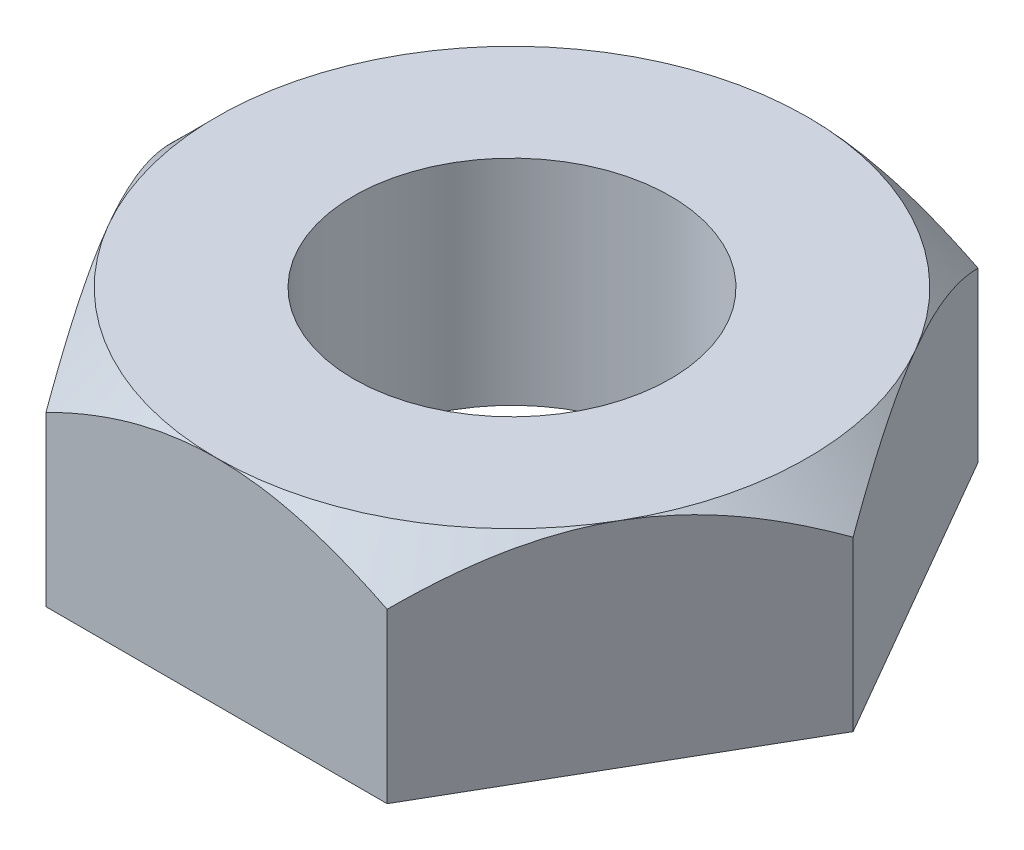
ISO-10303-21;
HEADER;
FILE_DESCRIPTION(('STEP AP214'),'2;1');
FILE_NAME('part.step','',(''),(''),'','','');
FILE_SCHEMA(('AUTOMOTIVE_DESIGN { 1 0 10303 214 1 1 1 1 }'));
ENDSEC;
DATA;
#1=APPLICATION_CONTEXT('core data for automotive mechanical design processes');
#2=APPLICATION_PROTOCOL_DEFINITION('international standard','automotive_design',2000,#1);
#3=PRODUCT_CONTEXT('',#1,'mechanical');
#4=PRODUCT('Part','Part','',(#3));
#5=PRODUCT_RELATED_PRODUCT_CATEGORY('part','',(#4));
#6=PRODUCT_DEFINITION_FORMATION('','',#4);
#7=PRODUCT_DEFINITION_CONTEXT('part definition',#1,'design');
#8=PRODUCT_DEFINITION('design','',#6,#7);
#9=PRODUCT_DEFINITION_SHAPE('','',#8);
#10=(LENGTH_UNIT() NAMED_UNIT(*) SI_UNIT(.MILLI.,.METRE.));
#11=(NAMED_UNIT(*) PLANE_ANGLE_UNIT() SI_UNIT($,.RADIAN.));
#12=(NAMED_UNIT(*) SI_UNIT($,.STERADIAN.) SOLID_ANGLE_UNIT());
#13=UNCERTAINTY_MEASURE_WITH_UNIT(LENGTH_MEASURE(1.E-05),#10,'distance_accuracy_value','');
#14=(GEOMETRIC_REPRESENTATION_CONTEXT(3) GLOBAL_UNCERTAINTY_ASSIGNED_CONTEXT((#13)) GLOBAL_UNIT_ASSIGNED_CONTEXT((#10,
#11,#12)) REPRESENTATION_CONTEXT('',''));
#15=CARTESIAN_POINT('',(0.,0.,0.));
#16=DIRECTION('',(0.,0.,1.));
#17=DIRECTION('',(1.,0.,0.));
#18=AXIS2_PLACEMENT_3D('',#15,#16,#17);
#19=CARTESIAN_POINT('',(0.,25.,0.));
#20=DIRECTION('',(0.,1.,0.));
#21=DIRECTION('',(0.,0.,1.));
#22=AXIS2_PLACEMENT_3D('',#19,#20,#21);
#23=PLANE('',#22);
#24=CARTESIAN_POINT('',(0.,25.,0.));
#25=DIRECTION('',(0.,1.,0.));
#26=DIRECTION('',(0.,0.,1.));
#27=AXIS2_PLACEMENT_3D('',#24,#25,#26);
#28=CIRCLE('',#27,18.5);
#29=CARTESIAN_POINT('',(0.,25.,18.5));
#30=VERTEX_POINT('',#29);
#31=EDGE_CURVE('E268',#30,#30,#28,.T.);
#32=ORIENTED_EDGE('',*,*,#31,.F.);
#33=EDGE_LOOP('',(#32));
#34=FACE_BOUND('',#33,.T.);
#35=CARTESIAN_POINT('',(0.,25.,0.));
#36=DIRECTION('',(0.,1.,0.));
#37=DIRECTION('',(0.,0.,1.));
#38=AXIS2_PLACEMENT_3D('',#35,#36,#37);
#39=CIRCLE('',#38,34.5);
#40=CARTESIAN_POINT('',(-29.877876430563,25.,17.2500000000002));
#41=VERTEX_POINT('',#40);
#42=CARTESIAN_POINT('',(3.60822483003176E-13,25.,34.5));
#43=VERTEX_POINT('',#42);
#44=EDGE_CURVE('E142',#41,#43,#39,.T.);
#45=ORIENTED_EDGE('',*,*,#44,.T.);
#46=CARTESIAN_POINT('',(29.8778764305634,25.,17.2499999999999));
#47=VERTEX_POINT('',#46);
#48=EDGE_CURVE('E126',#43,#47,#39,.T.);
#49=ORIENTED_EDGE('',*,*,#48,.T.);
#50=CARTESIAN_POINT('',(29.8778764305631,25.,-17.25));
#51=VERTEX_POINT('',#50);
#52=EDGE_CURVE('E116',#47,#51,#39,.T.);
#53=ORIENTED_EDGE('',*,*,#52,.T.);
#54=CARTESIAN_POINT('',(-1.20185167898972E-13,25.,-34.5));
#55=VERTEX_POINT('',#54);
#56=EDGE_CURVE('E60',#51,#55,#39,.T.);
#57=ORIENTED_EDGE('',*,*,#56,.T.);
#58=CARTESIAN_POINT('',(-29.8778764305632,25.,-17.2499999999998));
#59=VERTEX_POINT('',#58);
#60=EDGE_CURVE('E68',#55,#59,#39,.T.);
#61=ORIENTED_EDGE('',*,*,#60,.T.);
#62=EDGE_CURVE('E146',#59,#41,#39,.T.);
#63=ORIENTED_EDGE('',*,*,#62,.T.);
#64=EDGE_LOOP('',(#45,#49,#53,#57,#61,#63));
#65=FACE_BOUND('',#64,.T.);
#66=ADVANCED_FACE('F38',(#34,#65),#23,.T.);
#67=CARTESIAN_POINT('',(19.9185842870425,25.,34.4999999999998));
#68=DIRECTION('',(-0.866025403784441,0.,-0.499999999999995));
#69=DIRECTION('',(-0.499999999999995,0.,0.866025403784441));
#70=AXIS2_PLACEMENT_3D('',#67,#68,#69);
#71=PLANE('',#70);
#72=CARTESIAN_POINT('',(19.9184688169887,19.6627159553599,34.5001999999998));
#73=CARTESIAN_POINT('',(20.2609064330095,20.0050974602634,33.9070806506289));
#74=CARTESIAN_POINT('',(20.6060258774002,20.3370310575914,33.3093162382643));
#75=CARTESIAN_POINT('',(21.3020457610891,20.9766838039428,32.1037744366369));
#76=CARTESIAN_POINT('',(21.6529492327176,21.2843897293406,31.4959917952241));
#77=CARTESIAN_POINT('',(22.3626094509886,21.8735715205033,30.2668242410682));
#78=CARTESIAN_POINT('',(22.7213996575819,22.1548871259177,29.6453813739904));
#79=CARTESIAN_POINT('',(23.4448731210173,22.6851784375072,28.3922885773926));
#80=CARTESIAN_POINT('',(23.8095554673209,22.9341590878028,27.7606402249713));
#81=CARTESIAN_POINT('',(24.5389204879796,23.3918858727038,26.4973429519269));
#82=CARTESIAN_POINT('',(24.9035131138699,23.6012027501782,25.8658499998199));
#83=CARTESIAN_POINT('',(25.6378697047822,23.9801830016185,24.5939070734867));
#84=CARTESIAN_POINT('',(26.0076339228205,24.1498444282282,23.9534566610235));
#85=CARTESIAN_POINT('',(26.7506510016062,24.4451967498276,22.6665133296752));
#86=CARTESIAN_POINT('',(27.1238936281478,24.570989987992,22.0200381369546));
#87=CARTESIAN_POINT('',(27.8735591371452,24.7758286124016,20.7215793866892));
#88=CARTESIAN_POINT('',(28.2499815359011,24.8548809833538,20.0695966669369));
#89=CARTESIAN_POINT('',(28.8972588629573,24.9485018389381,18.9484794498883));
#90=CARTESIAN_POINT('',(29.1676946202353,24.9750148451492,18.4800709780993));
#91=CARTESIAN_POINT('',(29.7088862428974,25.0025846344729,17.5426995910179));
#92=CARTESIAN_POINT('',(29.979642091504,25.0036426973578,17.0737367047849));
#93=CARTESIAN_POINT('',(30.5209731671225,24.9802774378916,16.1361237780976));
#94=CARTESIAN_POINT('',(30.7915482937673,24.9558449249192,15.6674739114844));
#95=CARTESIAN_POINT('',(31.3318400708228,24.8818619414036,14.7316611027128));
#96=CARTESIAN_POINT('',(31.6015567064353,24.8323110402202,14.2644981861854));
#97=CARTESIAN_POINT('',(32.1398748180916,24.7087619795484,13.332103866162));
#98=CARTESIAN_POINT('',(32.4084747809343,24.6347375575662,12.8668750836074));
#99=CARTESIAN_POINT('',(32.9437958210044,24.4633022174695,11.9396718438453));
#100=CARTESIAN_POINT('',(33.2105168881164,24.3658911735453,11.4776974041584));
#101=CARTESIAN_POINT('',(33.7416511792806,24.1489787120485,10.5577458262199));
#102=CARTESIAN_POINT('',(34.0060647765429,24.0294809388244,10.0997680415496));
#103=CARTESIAN_POINT('',(34.5323490857841,23.7698130461655,9.1882168787174));
#104=CARTESIAN_POINT('',(34.794219591567,23.6296412651358,8.73464385769774));
#105=CARTESIAN_POINT('',(35.4683958533008,23.2420658707144,7.56693631911796));
#106=CARTESIAN_POINT('',(35.8786169112636,22.9800736636548,6.85641260439157));
#107=CARTESIAN_POINT('',(36.6916483649018,22.4139013541253,5.44820081853867));
#108=CARTESIAN_POINT('',(37.0944585365016,22.1097199783909,4.75051313552227));
#109=CARTESIAN_POINT('',(37.8914764628389,21.4659219717889,3.37003759256283));
#110=CARTESIAN_POINT('',(38.285706795852,21.1264167829413,2.68721062589934));
#111=CARTESIAN_POINT('',(38.8716032281725,20.5939907189296,1.6724082371469));
#112=CARTESIAN_POINT('',(39.0659430757274,20.412705097944,1.33580174724659));
#113=CARTESIAN_POINT('',(39.4528920822669,20.0429569196051,0.665586407981835));
#114=CARTESIAN_POINT('',(39.6455013652519,19.854494881616,0.331977343842385));
#115=CARTESIAN_POINT('',(39.837284044138,19.6627159553599,-0.000200000000000729));
#116=B_SPLINE_CURVE_WITH_KNOTS('',3,(#72,#73,#74,#75,#76,#77,#78,#79,#80,#81,#82,#83,#84,#85,
#86,#87,#88,#89,#90,#91,#92,#93,#94,#95,#96,#97,#98,#99,#100,#101,#102,#103,#104,#105,#106,#107,
#108,#109,#110,#111,#112,#113,#114,#115),.UNSPECIFIED.,.F.,.F.,(4,2,2,2,2,2,2,2,2,2,2,2,2,2,2,2,
2,2,2,2,2,4),(0.,2.29716343643282,4.59557211159877,6.90713979481504,9.21835361457562,
11.4932505585247,13.7682591921502,16.0379242228679,18.3072500011214,19.9312579145987,
21.5551841793082,23.1796961526778,24.804235978315,26.43052478409,28.0568223387684,
29.6828517907117,31.3090119999006,33.8913592529945,36.4737844580151,39.0482962319264,
40.3348703274372,41.6213514886578),.UNSPECIFIED.);
#117=CARTESIAN_POINT('',(19.9185842870425,19.6628314259158,34.4999999999998));
#118=VERTEX_POINT('',#117);
#119=EDGE_CURVE('E131',#118,#47,#116,.T.);
#120=ORIENTED_EDGE('',*,*,#119,.F.);
#121=DIRECTION('',(0.,-1.,0.));
#122=VECTOR('',#121,1.);
#123=CARTESIAN_POINT('',(19.9185842870425,25.,34.4999999999998));
#124=LINE('',#123,#122);
#125=CARTESIAN_POINT('',(19.9185842870425,0.,34.4999999999998));
#126=VERTEX_POINT('',#125);
#127=EDGE_CURVE('E244',#118,#126,#124,.T.);
#128=ORIENTED_EDGE('',*,*,#127,.T.);
#129=DIRECTION('',(0.499999999999995,0.,-0.866025403784441));
#130=VECTOR('',#129,1.);
#131=CARTESIAN_POINT('',(19.9185842870425,0.,34.4999999999998));
#132=LINE('',#131,#130);
#133=CARTESIAN_POINT('',(39.8371685740842,0.,0.));
#134=VERTEX_POINT('',#133);
#135=EDGE_CURVE('E266',#126,#134,#132,.T.);
#136=ORIENTED_EDGE('',*,*,#135,.T.);
#137=DIRECTION('',(0.,-1.,0.));
#138=VECTOR('',#137,1.);
#139=CARTESIAN_POINT('',(39.8371685740842,25.,0.));
#140=LINE('',#139,#138);
#141=CARTESIAN_POINT('',(39.8371685740842,19.6628314259158,0.));
#142=VERTEX_POINT('',#141);
#143=EDGE_CURVE('E139',#142,#134,#140,.T.);
#144=ORIENTED_EDGE('',*,*,#143,.F.);
#145=EDGE_CURVE('E120',#47,#142,#116,.T.);
#146=ORIENTED_EDGE('',*,*,#145,.F.);
#147=EDGE_LOOP('',(#120,#128,#136,#144,#146));
#148=FACE_BOUND('',#147,.T.);
#149=ADVANCED_FACE('F40',(#148),#71,.F.);
#150=CARTESIAN_POINT('',(39.8371685740842,25.,0.));
#151=DIRECTION('',(-0.866025403784438,0.,0.500000000000001));
#152=DIRECTION('',(0.500000000000001,0.,0.866025403784438));
#153=AXIS2_PLACEMENT_3D('',#150,#151,#152);
#154=PLANE('',#153);
#155=CARTESIAN_POINT('',(39.837284044138,19.6627159553599,0.0002));
#156=CARTESIAN_POINT('',(39.4948464281172,20.0050974602633,-0.592919349370883));
#157=CARTESIAN_POINT('',(39.1497269837265,20.3370310575914,-1.19068376173547));
#158=CARTESIAN_POINT('',(38.4537071000376,20.9766838039428,-2.39622556336292));
#159=CARTESIAN_POINT('',(38.1028036284091,21.2843897293406,-3.00400820477572));
#160=CARTESIAN_POINT('',(37.393143410138,21.8735715205034,-4.23317575893161));
#161=CARTESIAN_POINT('',(37.0343532035447,22.1548871259178,-4.85461862600941));
#162=CARTESIAN_POINT('',(36.3108797401093,22.6851784375073,-6.10771142260726));
#163=CARTESIAN_POINT('',(35.9461973938057,22.9341590878029,-6.7393597750286));
#164=CARTESIAN_POINT('',(35.216832373147,23.3918858727039,-8.00265704807292));
#165=CARTESIAN_POINT('',(34.8522397472567,23.6012027501783,-8.63415000017995));
#166=CARTESIAN_POINT('',(34.1178831563444,23.9801830016186,-9.90609292651318));
#167=CARTESIAN_POINT('',(33.7481189383061,24.1498444282283,-10.5465433389764));
#168=CARTESIAN_POINT('',(33.0051018595204,24.4451967498277,-11.8334866703247));
#169=CARTESIAN_POINT('',(32.6318592329787,24.5709899879921,-12.4799618630453));
#170=CARTESIAN_POINT('',(31.8821937239813,24.7758286124018,-13.7784206133107));
#171=CARTESIAN_POINT('',(31.5057713252254,24.854880983354,-14.430403333063));
#172=CARTESIAN_POINT('',(30.8584939981692,24.9485018389383,-15.5515205501116));
#173=CARTESIAN_POINT('',(30.5880582408911,24.9750148451494,-16.0199290219007));
#174=CARTESIAN_POINT('',(30.0468666182291,25.002584634473,-16.957300408982));
#175=CARTESIAN_POINT('',(29.7761107696225,25.0036426973579,-17.426263295215));
#176=CARTESIAN_POINT('',(29.2347796940039,24.9802774378918,-18.3638762219023));
#177=CARTESIAN_POINT('',(28.9642045673591,24.9558449249193,-18.8325260885155));
#178=CARTESIAN_POINT('',(28.4239127903037,24.8818619414037,-19.7683388972871));
#179=CARTESIAN_POINT('',(28.1541961546912,24.8323110402203,-20.2355018138145));
#180=CARTESIAN_POINT('',(27.6158780430349,24.7087619795486,-21.1678961338379));
#181=CARTESIAN_POINT('',(27.3472780801922,24.6347375575664,-21.6331249163925));
#182=CARTESIAN_POINT('',(26.811957040122,24.4633022174696,-22.5603281561546));
#183=CARTESIAN_POINT('',(26.5452359730101,24.3658911735454,-23.0223025958415));
#184=CARTESIAN_POINT('',(26.0141016818459,24.1489787120487,-23.94225417378));
#185=CARTESIAN_POINT('',(25.7496880845836,24.0294809388245,-24.4002319584503));
#186=CARTESIAN_POINT('',(25.2234037753423,23.7698130461657,-25.3117831212825));
#187=CARTESIAN_POINT('',(24.9615332695595,23.6296412651359,-25.7653561423021));
#188=CARTESIAN_POINT('',(24.2873570078257,23.2420658707145,-26.9330636808819));
#189=CARTESIAN_POINT('',(23.8771359498627,22.9800736636549,-27.6435873956083));
#190=CARTESIAN_POINT('',(23.0641044962246,22.4139013541254,-29.0517991814613));
#191=CARTESIAN_POINT('',(22.6612943246247,22.109719978391,-29.7494868644777));
#192=CARTESIAN_POINT('',(21.8642763982874,21.4659219717889,-31.1299624074372));
#193=CARTESIAN_POINT('',(21.4700460652743,21.1264167829413,-31.8127893741007));
#194=CARTESIAN_POINT('',(20.8841496329538,20.5939907189296,-32.8275917628531));
#195=CARTESIAN_POINT('',(20.6898097853988,20.4127050979441,-33.1641982527534));
#196=CARTESIAN_POINT('',(20.3028607788593,20.0429569196052,-33.8344135920182));
#197=CARTESIAN_POINT('',(20.1102514958743,19.854494881616,-34.1680226561577));
#198=CARTESIAN_POINT('',(19.9184688169882,19.6627159553599,-34.5002000000001));
#199=B_SPLINE_CURVE_WITH_KNOTS('',3,(#155,#156,#157,#158,#159,#160,#161,#162,#163,#164,#165,
#166,#167,#168,#169,#170,#171,#172,#173,#174,#175,#176,#177,#178,#179,#180,#181,#182,#183,#184,
#185,#186,#187,#188,#189,#190,#191,#192,#193,#194,#195,#196,#197,#198),.UNSPECIFIED.,.F.,.F.,(4,
2,2,2,2,2,2,2,2,2,2,2,2,2,2,2,2,2,2,2,2,4),(0.,2.29716343643286,4.59557211159884,
6.90713979481515,9.21835361457576,11.4932505585249,13.7682591921504,16.0379242228681,
18.3072500011216,19.931257914599,21.5551841793085,23.179696152678,24.8042359783153,
26.4305247840903,28.0568223387686,29.682851790712,31.3090119999009,33.8913592529948,
36.4737844580155,39.0482962319268,40.3348703274377,41.6213514886583),.UNSPECIFIED.);
#200=EDGE_CURVE('E122',#142,#51,#199,.T.);
#201=ORIENTED_EDGE('',*,*,#200,.F.);
#202=ORIENTED_EDGE('',*,*,#143,.T.);
#203=DIRECTION('',(-0.500000000000001,0.,-0.866025403784438));
#204=VECTOR('',#203,1.);
#205=CARTESIAN_POINT('',(39.8371685740842,0.,0.));
#206=LINE('',#205,#204);
#207=CARTESIAN_POINT('',(19.918584287042,0.,-34.5000000000001));
#208=VERTEX_POINT('',#207);
#209=EDGE_CURVE('E264',#134,#208,#206,.T.);
#210=ORIENTED_EDGE('',*,*,#209,.T.);
#211=DIRECTION('',(0.,-1.,0.));
#212=VECTOR('',#211,1.);
#213=CARTESIAN_POINT('',(19.918584287042,25.,-34.5000000000001));
#214=LINE('',#213,#212);
#215=CARTESIAN_POINT('',(19.918584287042,19.6628314259158,-34.5000000000001));
#216=VERTEX_POINT('',#215);
#217=EDGE_CURVE('E245',#216,#208,#214,.T.);
#218=ORIENTED_EDGE('',*,*,#217,.F.);
#219=EDGE_CURVE('E195',#51,#216,#199,.T.);
#220=ORIENTED_EDGE('',*,*,#219,.F.);
#221=EDGE_LOOP('',(#201,#202,#210,#218,#220));
#222=FACE_BOUND('',#221,.T.);
#223=ADVANCED_FACE('F206',(#222),#154,.F.);
#224=CARTESIAN_POINT('',(19.918584287042,25.,-34.5000000000001));
#225=DIRECTION('',(0.,0.,1.));
#226=DIRECTION('',(1.,0.,0.));
#227=AXIS2_PLACEMENT_3D('',#224,#225,#226);
#228=PLANE('',#227);
#229=CARTESIAN_POINT('',(60.9918898428678,-10.5732518626367,-34.5000000000002));
#230=CARTESIAN_POINT('',(60.0923697626066,-9.79033915284692,-34.5000000000002));
#231=CARTESIAN_POINT('',(59.1907962925268,-9.00977711913091,-34.5000000000002));
#232=CARTESIAN_POINT('',(57.382986409492,-7.45404393063385,-34.5000000000002));
#233=CARTESIAN_POINT('',(56.4767499229087,-6.67887286143269,-34.5000000000002));
#234=CARTESIAN_POINT('',(54.6586675396788,-5.13428020344326,-34.5000000000002));
#235=CARTESIAN_POINT('',(53.7468192507788,-4.3648614284295,-34.5000000000002));
#236=CARTESIAN_POINT('',(51.9172787842732,-2.83300548523328,-34.5000000000002));
#237=CARTESIAN_POINT('',(50.9995866264299,-2.07056829346234,-34.5000000000002));
#238=CARTESIAN_POINT('',(49.1373808698745,-0.537047116308871,-34.5000000000002));
#239=CARTESIAN_POINT('',(48.1927207850943,0.233859141089686,-34.5000000000002));
#240=CARTESIAN_POINT('',(46.2955667813874,1.76598493061427,-34.5000000000002));
#241=CARTESIAN_POINT('',(45.3430728462188,2.52720444264839,-34.5000000000002));
#242=CARTESIAN_POINT('',(43.4293764102385,4.03815789170133,-34.5000000000002));
#243=CARTESIAN_POINT('',(42.4681760410817,4.78789452531518,-34.5000000000002));
#244=CARTESIAN_POINT('',(40.535543198685,6.27407970233851,-34.5000000000001));
#245=CARTESIAN_POINT('',(39.5641107347295,7.01052825780375,-34.5000000000001));
#246=CARTESIAN_POINT('',(37.60826596464,8.46857663163964,-34.5000000000001));
#247=CARTESIAN_POINT('',(36.6238390325788,9.19015686639843,-34.5000000000001));
#248=CARTESIAN_POINT('',(34.6413687547093,10.6144307348655,-34.5000000000001));
#249=CARTESIAN_POINT('',(33.6433252582862,11.3171241594082,-34.5000000000001));
#250=CARTESIAN_POINT('',(31.6306543762819,12.7002857692006,-34.5000000000001));
#251=CARTESIAN_POINT('',(30.6160135504459,13.3807344529471,-34.5000000000001));
#252=CARTESIAN_POINT('',(28.5685454316405,14.7137540425474,-34.5000000000001));
#253=CARTESIAN_POINT('',(27.5357185342731,15.3663255537585,-34.5000000000001));
#254=CARTESIAN_POINT('',(25.4564624866758,16.6326904435078,-34.5000000000001));
#255=CARTESIAN_POINT('',(24.4101810541857,17.2467252851532,-34.5000000000001));
#256=CARTESIAN_POINT('',(22.2938689202038,18.4329993677194,-34.5000000000001));
#257=CARTESIAN_POINT('',(21.2238353712944,19.0052335618854,-34.5000000000001));
#258=CARTESIAN_POINT('',(19.0588729854227,20.0967277197112,-34.5000000000001));
#259=CARTESIAN_POINT('',(17.9639826220799,20.6160635232232,-34.5000000000001));
#260=CARTESIAN_POINT('',(15.745746485598,21.5897580787009,-34.5000000000001));
#261=CARTESIAN_POINT('',(14.6224118430658,22.0441417984708,-34.5000000000001));
#262=CARTESIAN_POINT('',(12.9026215226215,22.6702007337877,-34.5));
#263=CARTESIAN_POINT('',(12.3168975621055,22.8715348194975,-34.5));
#264=CARTESIAN_POINT('',(11.1379492184713,23.2509663382729,-34.5));
#265=CARTESIAN_POINT('',(10.5447251355381,23.4290646981168,-34.5));
#266=CARTESIAN_POINT('',(9.35120537336118,23.7597380507505,-34.5));
#267=CARTESIAN_POINT('',(8.75090996930538,23.9123140332815,-34.5));
#268=CARTESIAN_POINT('',(7.54394832453885,24.1897141564694,-34.5));
#269=CARTESIAN_POINT('',(6.93728248067109,24.3145400151902,-34.5));
#270=CARTESIAN_POINT('',(5.72253049926418,24.5336898811453,-34.5));
#271=CARTESIAN_POINT('',(5.11447949634153,24.6282077159631,-34.5));
#272=CARTESIAN_POINT('',(3.89433912545016,24.7861701127945,-34.5));
#273=CARTESIAN_POINT('',(3.28224980039707,24.849615004486,-34.5));
#274=CARTESIAN_POINT('',(2.05562218761818,24.9442228617276,-34.5));
#275=CARTESIAN_POINT('',(1.44108412242021,24.9753886963566,-34.5));
#276=CARTESIAN_POINT('',(0.211215882962573,25.004830839578,-34.5));
#277=CARTESIAN_POINT('',(-0.404114291719124,25.0031071306397,-34.5));
#278=CARTESIAN_POINT('',(-1.63515730533166,24.9667644705599,-34.5));
#279=CARTESIAN_POINT('',(-2.25086798896065,24.9320728905144,-34.5));
#280=CARTESIAN_POINT('',(-3.47960218779404,24.8303774095851,-34.5));
#281=CARTESIAN_POINT('',(-4.09262569248917,24.7633733824442,-34.5));
#282=CARTESIAN_POINT('',(-5.31454715065864,24.5983117268742,-34.5));
#283=CARTESIAN_POINT('',(-5.92344448246396,24.5002495208433,-34.5));
#284=CARTESIAN_POINT('',(-7.13576519652755,24.2748050719989,-34.5));
#285=CARTESIAN_POINT('',(-7.73918852392812,24.1474225356885,-34.5));
#286=CARTESIAN_POINT('',(-8.94398727505165,23.8643507238381,-34.5));
#287=CARTESIAN_POINT('',(-9.54531545569032,23.7084612639764,-34.5));
#288=CARTESIAN_POINT('',(-10.7408091725898,23.3712575044684,-34.5));
#289=CARTESIAN_POINT('',(-11.3349742624299,23.1899416289924,-34.5));
#290=CARTESIAN_POINT('',(-12.515676881197,22.8042123038628,-34.5));
#291=CARTESIAN_POINT('',(-13.1022150376467,22.5998007680359,-34.5));
#292=CARTESIAN_POINT('',(-14.2675843833904,22.1701115293055,-34.5));
#293=CARTESIAN_POINT('',(-14.846415375761,21.9448332944087,-34.5));
#294=CARTESIAN_POINT('',(-16.1125319410947,21.4281533037804,-34.5));
#295=CARTESIAN_POINT('',(-16.7981156406905,21.1325850797623,-34.4999999999999));
#296=CARTESIAN_POINT('',(-18.1586087321118,20.5177376173205,-34.4999999999999));
#297=CARTESIAN_POINT('',(-18.8335169304291,20.1984557501504,-34.4999999999999));
#298=CARTESIAN_POINT('',(-20.1734420108206,19.5390509416403,-34.4999999999999));
#299=CARTESIAN_POINT('',(-20.8384540559035,19.1989181994668,-34.4999999999999));
#300=CARTESIAN_POINT('',(-22.1588722272936,18.5005893819621,-34.4999999999999));
#301=CARTESIAN_POINT('',(-22.8142786537157,18.1423938725377,-34.4999999999999));
#302=CARTESIAN_POINT('',(-24.117500237633,17.4094673299728,-34.4999999999999));
#303=CARTESIAN_POINT('',(-24.7652974189432,17.0347044045591,-34.4999999999999));
#304=CARTESIAN_POINT('',(-26.0526437138634,16.2712868143311,-34.4999999999999));
#305=CARTESIAN_POINT('',(-26.6921927695567,15.8826320520431,-34.4999999999999));
#306=CARTESIAN_POINT('',(-27.9635657524814,15.0932125163919,-34.4999999999999));
#307=CARTESIAN_POINT('',(-28.5953913441569,14.6924504192282,-34.4999999999999));
#308=CARTESIAN_POINT('',(-29.8520885603092,13.8801869786127,-34.4999999999999));
#309=CARTESIAN_POINT('',(-30.4769602044734,13.4686856655758,-34.4999999999999));
#310=CARTESIAN_POINT('',(-31.7237110699754,12.633932776227,-34.4999999999999));
#311=CARTESIAN_POINT('',(-32.345555698505,12.2106295889327,-34.4999999999999));
#312=CARTESIAN_POINT('',(-33.5833655555929,11.3555050501037,-34.4999999999999));
#313=CARTESIAN_POINT('',(-34.1993306892638,10.9236835614387,-34.4999999999999));
#314=CARTESIAN_POINT('',(-36.0391882087994,9.61687387159572,-34.4999999999999));
#315=CARTESIAN_POINT('',(-37.2550355423495,8.73054527854708,-34.4999999999999));
#316=CARTESIAN_POINT('',(-39.6673291660723,6.93480327428608,-34.4999999999999));
#317=CARTESIAN_POINT('',(-40.8637959878366,6.02541732336167,-34.4999999999999));
#318=CARTESIAN_POINT('',(-43.2415679821053,4.18711902162154,-34.4999999999999));
#319=CARTESIAN_POINT('',(-44.422873472527,3.25820708132635,-34.4999999999999));
#320=CARTESIAN_POINT('',(-46.91381865111,1.27177918083433,-34.4999999999998));
#321=CARTESIAN_POINT('',(-48.2218264344372,0.212219967573865,-34.4999999999998));
#322=CARTESIAN_POINT('',(-50.8246467462121,-1.9234615719109,-34.4999999999998));
#323=CARTESIAN_POINT('',(-52.119456680427,-2.99958705396496,-34.4999999999998));
#324=CARTESIAN_POINT('',(-54.6826273197565,-5.152625185102,-34.4999999999998));
#325=CARTESIAN_POINT('',(-55.9511201434086,-6.22938070441039,-34.4999999999998));
#326=CARTESIAN_POINT('',(-57.8466385362062,-7.85263486522463,-34.4999999999998));
#327=CARTESIAN_POINT('',(-58.4772023478656,-8.39501015706043,-34.4999999999998));
#328=CARTESIAN_POINT('',(-59.736142763622,-9.48228877320811,-34.4999999999998));
#329=CARTESIAN_POINT('',(-60.3645193759259,-10.0271920880162,-34.4999999999998));
#330=CARTESIAN_POINT('',(-60.991889842868,-10.5732518626367,-34.4999999999998));
#331=B_SPLINE_CURVE_WITH_KNOTS('',3,(#229,#230,#231,#232,#233,#234,#235,#236,#237,#238,#239,
#240,#241,#242,#243,#244,#245,#246,#247,#248,#249,#250,#251,#252,#253,#254,#255,#256,#257,#258,
#259,#260,#261,#262,#263,#264,#265,#266,#267,#268,#269,#270,#271,#272,#273,#274,#275,#276,#277,
#278,#279,#280,#281,#282,#283,#284,#285,#286,#287,#288,#289,#290,#291,#292,#293,#294,#295,#296,
#297,#298,#299,#300,#301,#302,#303,#304,#305,#306,#307,#308,#309,#310,#311,#312,#313,#314,#315,
#316,#317,#318,#319,#320,#321,#322,#323,#324,#325,#326,#327,#328,#329,#330),.UNSPECIFIED.,.F.,
.F.,(4,2,2,2,2,2,2,2,2,2,2,2,2,2,2,2,2,2,2,2,2,2,2,2,2,2,2,2,2,2,2,2,2,2,2,2,2,2,2,2,2,2,2,2,2,
2,2,2,2,2,4),(0.,3.57754504219973,7.15514674776247,10.7343969107433,14.3136349761497,
17.9714634024924,21.6292994145427,25.2862628402327,28.9432229479326,32.6047261975649,
36.2662699805197,39.9309420759919,43.5955345520526,47.2342282260866,50.8733604901409,
54.5071996763448,58.1396382240931,59.9973236445136,61.8549349467809,63.7124741953956,
65.569898408121,67.4151953661448,69.2604727455076,71.1055860958876,72.9507004297487,
74.7998890348491,76.6490848654849,78.4985533722568,80.348040393038,82.211051981652,
84.0741790834968,85.9371519099802,87.8001722457415,90.0393901001357,92.2788565517962,
94.519383845353,96.7598409867257,99.0048167388979,101.249808246277,103.49430710111,
105.738799599907,107.99546124587,110.252159250022,114.765581191263,119.273859319595,
123.782042759086,128.83182373898,133.882578894112,138.874121861082,141.369318886573,
143.864506539223),.UNSPECIFIED.);
#332=EDGE_CURVE('E200',#216,#55,#331,.T.);
#333=ORIENTED_EDGE('',*,*,#332,.F.);
#334=ORIENTED_EDGE('',*,*,#217,.T.);
#335=DIRECTION('',(-1.,0.,0.));
#336=VECTOR('',#335,1.);
#337=CARTESIAN_POINT('',(19.918584287042,0.,-34.5000000000001));
#338=LINE('',#337,#336);
#339=CARTESIAN_POINT('',(-19.9185842870423,0.,-34.4999999999999));
#340=VERTEX_POINT('',#339);
#341=EDGE_CURVE('E261',#208,#340,#338,.T.);
#342=ORIENTED_EDGE('',*,*,#341,.T.);
#343=DIRECTION('',(0.,-1.,0.));
#344=VECTOR('',#343,1.);
#345=CARTESIAN_POINT('',(-19.9185842870423,25.,-34.4999999999999));
#346=LINE('',#345,#344);
#347=CARTESIAN_POINT('',(-19.9185842870423,19.6628314259158,-34.4999999999999));
#348=VERTEX_POINT('',#347);
#349=EDGE_CURVE('E248',#348,#340,#346,.T.);
#350=ORIENTED_EDGE('',*,*,#349,.F.);
#351=EDGE_CURVE('E158',#55,#348,#331,.T.);
#352=ORIENTED_EDGE('',*,*,#351,.F.);
#353=EDGE_LOOP('',(#333,#334,#342,#350,#352));
#354=FACE_BOUND('',#353,.T.);
#355=ADVANCED_FACE('F209',(#354),#228,.F.);
#356=CARTESIAN_POINT('',(-19.9185842870423,25.,-34.4999999999999));
#357=DIRECTION('',(0.866025403784442,0.,0.499999999999995));
#358=DIRECTION('',(0.499999999999995,0.,-0.866025403784442));
#359=AXIS2_PLACEMENT_3D('',#356,#357,#358);
#360=PLANE('',#359);
#361=CARTESIAN_POINT('',(-19.9184688169884,19.6627159553599,-34.5001999999999));
#362=CARTESIAN_POINT('',(-20.2609064330093,20.0050974602634,-33.907080650629));
#363=CARTESIAN_POINT('',(-20.6060258773999,20.3370310575914,-33.3093162382645));
#364=CARTESIAN_POINT('',(-21.3020457610889,20.9766838039428,-32.103774436637));
#365=CARTESIAN_POINT('',(-21.6529492327173,21.2843897293406,-31.4959917952242));
#366=CARTESIAN_POINT('',(-22.3626094509884,21.8735715205034,-30.2668242410683));
#367=CARTESIAN_POINT('',(-22.7213996575817,22.1548871259178,-29.6453813739905));
#368=CARTESIAN_POINT('',(-23.4448731210171,22.6851784375073,-28.3922885773927));
#369=CARTESIAN_POINT('',(-23.8095554673207,22.9341590878029,-27.7606402249713));
#370=CARTESIAN_POINT('',(-24.5389204879794,23.3918858727039,-26.497342951927));
#371=CARTESIAN_POINT('',(-24.9035131138697,23.6012027501783,-25.86584999982));
#372=CARTESIAN_POINT('',(-25.637869704782,23.9801830016186,-24.5939070734867));
#373=CARTESIAN_POINT('',(-26.0076339228203,24.1498444282283,-23.9534566610235));
#374=CARTESIAN_POINT('',(-26.750651001606,24.4451967498277,-22.6665133296752));
#375=CARTESIAN_POINT('',(-27.1238936281477,24.5709899879921,-22.0200381369546));
#376=CARTESIAN_POINT('',(-27.873559137145,24.7758286124018,-20.7215793866891));
#377=CARTESIAN_POINT('',(-28.249981535901,24.854880983354,-20.0695966669368));
#378=CARTESIAN_POINT('',(-28.8972588629571,24.9485018389383,-18.9484794498882));
#379=CARTESIAN_POINT('',(-29.1676946202352,24.9750148451494,-18.4800709780992));
#380=CARTESIAN_POINT('',(-29.7088862428973,25.002584634473,-17.5426995910179));
#381=CARTESIAN_POINT('',(-29.9796420915038,25.0036426973579,-17.0737367047848));
#382=CARTESIAN_POINT('',(-30.5209731671224,24.9802774378918,-16.1361237780976));
#383=CARTESIAN_POINT('',(-30.7915482937672,24.9558449249193,-15.6674739114844));
#384=CARTESIAN_POINT('',(-31.3318400708226,24.8818619414037,-14.7316611027127));
#385=CARTESIAN_POINT('',(-31.6015567064351,24.8323110402203,-14.2644981861854));
#386=CARTESIAN_POINT('',(-32.1398748180915,24.7087619795486,-13.332103866162));
#387=CARTESIAN_POINT('',(-32.4084747809341,24.6347375575664,-12.8668750836074));
#388=CARTESIAN_POINT('',(-32.9437958210043,24.4633022174696,-11.9396718438452));
#389=CARTESIAN_POINT('',(-33.2105168881162,24.3658911735454,-11.4776974041584));
#390=CARTESIAN_POINT('',(-33.7416511792804,24.1489787120487,-10.5577458262199));
#391=CARTESIAN_POINT('',(-34.0060647765427,24.0294809388245,-10.0997680415495));
#392=CARTESIAN_POINT('',(-34.532349085784,23.7698130461657,-9.18821687871738));
#393=CARTESIAN_POINT('',(-34.7942195915668,23.629641265136,-8.73464385769772));
#394=CARTESIAN_POINT('',(-35.4683958533006,23.2420658707145,-7.56693631911791));
#395=CARTESIAN_POINT('',(-35.8786169112635,22.9800736636549,-6.8564126043915));
#396=CARTESIAN_POINT('',(-36.6916483649017,22.4139013541254,-5.44820081853857));
#397=CARTESIAN_POINT('',(-37.0944585365015,22.109719978391,-4.75051313552215));
#398=CARTESIAN_POINT('',(-37.8914764628389,21.465921971789,-3.37003759256266));
#399=CARTESIAN_POINT('',(-38.285706795852,21.1264167829413,-2.68721062589915));
#400=CARTESIAN_POINT('',(-38.8716032281725,20.5939907189297,-1.67240823714667));
#401=CARTESIAN_POINT('',(-39.0659430757274,20.4127050979441,-1.33580174724636));
#402=CARTESIAN_POINT('',(-39.4528920822669,20.0429569196052,-0.66558640798158));
#403=CARTESIAN_POINT('',(-39.6455013652519,19.854494881616,-0.331977343842119));
#404=CARTESIAN_POINT('',(-39.837284044138,19.6627159553599,0.000200000000277121));
#405=B_SPLINE_CURVE_WITH_KNOTS('',3,(#361,#362,#363,#364,#365,#366,#367,#368,#369,#370,#371,
#372,#373,#374,#375,#376,#377,#378,#379,#380,#381,#382,#383,#384,#385,#386,#387,#388,#389,#390,
#391,#392,#393,#394,#395,#396,#397,#398,#399,#400,#401,#402,#403,#404),.UNSPECIFIED.,.F.,.F.,(4,
2,2,2,2,2,2,2,2,2,2,2,2,2,2,2,2,2,2,2,2,4),(0.,2.29716343643286,4.59557211159883,
6.90713979481514,9.21835361457576,11.4932505585249,13.7682591921504,16.0379242228681,
18.3072500011216,19.9312579145989,21.5551841793084,23.179696152678,24.8042359783153,
26.4305247840903,28.0568223387686,29.682851790712,31.3090119999009,33.8913592529948,
36.4737844580155,39.0482962319268,40.3348703274377,41.6213514886583),.UNSPECIFIED.);
#406=EDGE_CURVE('E155',#348,#59,#405,.T.);
#407=ORIENTED_EDGE('',*,*,#406,.F.);
#408=ORIENTED_EDGE('',*,*,#349,.T.);
#409=DIRECTION('',(-0.499999999999995,0.,0.866025403784441));
#410=VECTOR('',#409,1.);
#411=CARTESIAN_POINT('',(-19.9185842870423,0.,-34.4999999999999));
#412=LINE('',#411,#410);
#413=CARTESIAN_POINT('',(-39.8371685740842,0.,2.78181461337526E-13));
#414=VERTEX_POINT('',#413);
#415=EDGE_CURVE('E259',#340,#414,#412,.T.);
#416=ORIENTED_EDGE('',*,*,#415,.T.);
#417=DIRECTION('',(0.,-1.,0.));
#418=VECTOR('',#417,1.);
#419=CARTESIAN_POINT('',(-39.8371685740842,25.,2.78181461337526E-13));
#420=LINE('',#419,#418);
#421=CARTESIAN_POINT('',(-39.8371685740842,19.6628314259158,2.77730281278332E-13));
#422=VERTEX_POINT('',#421);
#423=EDGE_CURVE('E165',#422,#414,#420,.T.);
#424=ORIENTED_EDGE('',*,*,#423,.F.);
#425=EDGE_CURVE('E151',#59,#422,#405,.T.);
#426=ORIENTED_EDGE('',*,*,#425,.F.);
#427=EDGE_LOOP('',(#407,#408,#416,#424,#426));
#428=FACE_BOUND('',#427,.T.);
#429=ADVANCED_FACE('F163',(#428),#360,.F.);
#430=CARTESIAN_POINT('',(-39.8371685740842,25.,2.78181461337526E-13));
#431=DIRECTION('',(0.866025403784435,0.,-0.500000000000007));
#432=DIRECTION('',(-0.500000000000007,0.,-0.866025403784435));
#433=AXIS2_PLACEMENT_3D('',#430,#431,#432);
#434=PLANE('',#433);
#435=CARTESIAN_POINT('',(-39.837284044138,19.6627159553599,-0.000199999999721819));
#436=CARTESIAN_POINT('',(-39.4948464281172,20.0050974602634,0.592919349371157));
#437=CARTESIAN_POINT('',(-39.1497269837265,20.3370310575914,1.19068376173574));
#438=CARTESIAN_POINT('',(-38.4537071000375,20.9766838039428,2.39622556336319));
#439=CARTESIAN_POINT('',(-38.1028036284091,21.2843897293406,3.00400820477599));
#440=CARTESIAN_POINT('',(-37.393143410138,21.8735715205034,4.23317575893187));
#441=CARTESIAN_POINT('',(-37.0343532035447,22.1548871259178,4.85461862600967));
#442=CARTESIAN_POINT('',(-36.3108797401093,22.6851784375073,6.10771142260751));
#443=CARTESIAN_POINT('',(-35.9461973938056,22.9341590878029,6.73935977502885));
#444=CARTESIAN_POINT('',(-35.216832373147,23.3918858727039,8.00265704807317));
#445=CARTESIAN_POINT('',(-34.8522397472566,23.6012027501783,8.63415000018019));
#446=CARTESIAN_POINT('',(-34.1178831563443,23.9801830016186,9.90609292651342));
#447=CARTESIAN_POINT('',(-33.748118938306,24.1498444282283,10.5465433389766));
#448=CARTESIAN_POINT('',(-33.0051018595203,24.4451967498277,11.8334866703249));
#449=CARTESIAN_POINT('',(-32.6318592329786,24.5709899879921,12.4799618630455));
#450=CARTESIAN_POINT('',(-31.8821937239812,24.7758286124018,13.778420613311));
#451=CARTESIAN_POINT('',(-31.5057713252253,24.854880983354,14.4304033330633));
#452=CARTESIAN_POINT('',(-30.8584939981691,24.9485018389383,15.5515205501119));
#453=CARTESIAN_POINT('',(-30.588058240891,24.9750148451494,16.0199290219009));
#454=CARTESIAN_POINT('',(-30.046866618229,25.002584634473,16.9573004089822));
#455=CARTESIAN_POINT('',(-29.7761107696224,25.0036426973579,17.4262632952152));
#456=CARTESIAN_POINT('',(-29.2347796940038,24.9802774378918,18.3638762219025));
#457=CARTESIAN_POINT('',(-28.964204567359,24.9558449249193,18.8325260885157));
#458=CARTESIAN_POINT('',(-28.4239127903036,24.8818619414037,19.7683388972873));
#459=CARTESIAN_POINT('',(-28.1541961546911,24.8323110402203,20.2355018138147));
#460=CARTESIAN_POINT('',(-27.6158780430347,24.7087619795486,21.1678961338381));
#461=CARTESIAN_POINT('',(-27.347278080192,24.6347375575664,21.6331249163927));
#462=CARTESIAN_POINT('',(-26.8119570401218,24.4633022174696,22.5603281561548));
#463=CARTESIAN_POINT('',(-26.5452359730099,24.3658911735454,23.0223025958416));
#464=CARTESIAN_POINT('',(-26.0141016818457,24.1489787120487,23.9422541737801));
#465=CARTESIAN_POINT('',(-25.7496880845834,24.0294809388245,24.4002319584505));
#466=CARTESIAN_POINT('',(-25.2234037753421,23.7698130461657,25.3117831212827));
#467=CARTESIAN_POINT('',(-24.9615332695593,23.6296412651359,25.7653561423023));
#468=CARTESIAN_POINT('',(-24.2873570078255,23.2420658707145,26.9330636808821));
#469=CARTESIAN_POINT('',(-23.8771359498625,22.9800736636549,27.6435873956085));
#470=CARTESIAN_POINT('',(-23.0641044962243,22.4139013541254,29.0517991814614));
#471=CARTESIAN_POINT('',(-22.6612943246245,22.109719978391,29.7494868644778));
#472=CARTESIAN_POINT('',(-21.8642763982872,21.465921971789,31.1299624074373));
#473=CARTESIAN_POINT('',(-21.470046065274,21.1264167829413,31.8127893741008));
#474=CARTESIAN_POINT('',(-20.8841496329535,20.5939907189297,32.8275917628533));
#475=CARTESIAN_POINT('',(-20.6898097853986,20.4127050979441,33.1641982527536));
#476=CARTESIAN_POINT('',(-20.3028607788591,20.0429569196052,33.8344135920184));
#477=CARTESIAN_POINT('',(-20.110251495874,19.854494881616,34.1680226561578));
#478=CARTESIAN_POINT('',(-19.9184688169879,19.6627159553599,34.5002000000002));
#479=B_SPLINE_CURVE_WITH_KNOTS('',3,(#435,#436,#437,#438,#439,#440,#441,#442,#443,#444,#445,
#446,#447,#448,#449,#450,#451,#452,#453,#454,#455,#456,#457,#458,#459,#460,#461,#462,#463,#464,
#465,#466,#467,#468,#469,#470,#471,#472,#473,#474,#475,#476,#477,#478),.UNSPECIFIED.,.F.,.F.,(4,
2,2,2,2,2,2,2,2,2,2,2,2,2,2,2,2,2,2,2,2,4),(0.,2.29716343643286,4.59557211159884,
6.90713979481514,9.21835361457576,11.4932505585249,13.7682591921504,16.0379242228682,
18.3072500011217,19.931257914599,21.5551841793085,23.179696152678,24.8042359783153,
26.4305247840903,28.0568223387686,29.682851790712,31.3090119999009,33.8913592529948,
36.4737844580155,39.0482962319268,40.3348703274377,41.6213514886583),.UNSPECIFIED.);
#480=EDGE_CURVE('E144',#422,#41,#479,.T.);
#481=ORIENTED_EDGE('',*,*,#480,.F.);
#482=ORIENTED_EDGE('',*,*,#423,.T.);
#483=DIRECTION('',(0.500000000000007,0.,0.866025403784435));
#484=VECTOR('',#483,1.);
#485=CARTESIAN_POINT('',(-39.8371685740842,0.,2.78181461337526E-13));
#486=LINE('',#485,#484);
#487=CARTESIAN_POINT('',(-19.9185842870418,0.,34.5000000000002));
#488=VERTEX_POINT('',#487);
#489=EDGE_CURVE('E257',#414,#488,#486,.T.);
#490=ORIENTED_EDGE('',*,*,#489,.T.);
#491=DIRECTION('',(0.,-1.,0.));
#492=VECTOR('',#491,1.);
#493=CARTESIAN_POINT('',(-19.9185842870418,25.,34.5000000000002));
#494=LINE('',#493,#492);
#495=CARTESIAN_POINT('',(-19.9185842870418,19.6628314259158,34.5000000000002));
#496=VERTEX_POINT('',#495);
#497=EDGE_CURVE('E240',#496,#488,#494,.T.);
#498=ORIENTED_EDGE('',*,*,#497,.F.);
#499=EDGE_CURVE('E143',#41,#496,#479,.T.);
#500=ORIENTED_EDGE('',*,*,#499,.F.);
#501=EDGE_LOOP('',(#481,#482,#490,#498,#500));
#502=FACE_BOUND('',#501,.T.);
#503=ADVANCED_FACE('F217',(#502),#434,.F.);
#504=CARTESIAN_POINT('',(-19.9185842870418,25.,34.5000000000002));
#505=DIRECTION('',(0.,0.,-1.));
#506=DIRECTION('',(-1.,0.,0.));
#507=AXIS2_PLACEMENT_3D('',#504,#505,#506);
#508=PLANE('',#507);
#509=CARTESIAN_POINT('',(-60.9918898428676,-10.5732518626367,34.5000000000006));
#510=CARTESIAN_POINT('',(-60.0923697626064,-9.79033915284692,34.5000000000006));
#511=CARTESIAN_POINT('',(-59.1907962925266,-9.00977711913091,34.5000000000006));
#512=CARTESIAN_POINT('',(-57.3829864094918,-7.45404393063386,34.5000000000006));
#513=CARTESIAN_POINT('',(-56.4767499229085,-6.6788728614327,34.5000000000006));
#514=CARTESIAN_POINT('',(-54.6586675396786,-5.13428020344327,34.5000000000006));
#515=CARTESIAN_POINT('',(-53.7468192507785,-4.36486142842951,34.5000000000006));
#516=CARTESIAN_POINT('',(-51.9172787842729,-2.83300548523328,34.5000000000005));
#517=CARTESIAN_POINT('',(-50.9995866264297,-2.07056829346234,34.5000000000005));
#518=CARTESIAN_POINT('',(-49.1373808698743,-0.537047116308866,34.5000000000005));
#519=CARTESIAN_POINT('',(-48.1927207850941,0.233859141089687,34.5000000000005));
#520=CARTESIAN_POINT('',(-46.2955667813872,1.76598493061428,34.5000000000005));
#521=CARTESIAN_POINT('',(-45.3430728462186,2.52720444264839,34.5000000000005));
#522=CARTESIAN_POINT('',(-43.4293764102382,4.03815789170133,34.5000000000005));
#523=CARTESIAN_POINT('',(-42.4681760410815,4.78789452531518,34.5000000000004));
#524=CARTESIAN_POINT('',(-40.5355431986848,6.2740797023385,34.5000000000004));
#525=CARTESIAN_POINT('',(-39.5641107347292,7.01052825780375,34.5000000000004));
#526=CARTESIAN_POINT('',(-37.6082659646397,8.46857663163964,34.5000000000004));
#527=CARTESIAN_POINT('',(-36.6238390325785,9.19015686639843,34.5000000000004));
#528=CARTESIAN_POINT('',(-34.641368754709,10.6144307348655,34.5000000000004));
#529=CARTESIAN_POINT('',(-33.6433252582859,11.3171241594082,34.5000000000003));
#530=CARTESIAN_POINT('',(-31.6306543762816,12.7002857692006,34.5000000000003));
#531=CARTESIAN_POINT('',(-30.6160135504456,13.3807344529471,34.5000000000003));
#532=CARTESIAN_POINT('',(-28.5685454316403,14.7137540425474,34.5000000000003));
#533=CARTESIAN_POINT('',(-27.5357185342728,15.3663255537585,34.5000000000003));
#534=CARTESIAN_POINT('',(-25.4564624866756,16.6326904435078,34.5000000000003));
#535=CARTESIAN_POINT('',(-24.4101810541854,17.2467252851532,34.5000000000003));
#536=CARTESIAN_POINT('',(-22.2938689202035,18.4329993677194,34.5000000000002));
#537=CARTESIAN_POINT('',(-21.2238353712942,19.0052335618854,34.5000000000002));
#538=CARTESIAN_POINT('',(-19.0588729854225,20.0967277197111,34.5000000000002));
#539=CARTESIAN_POINT('',(-17.9639826220797,20.6160635232231,34.5000000000002));
#540=CARTESIAN_POINT('',(-15.7457464855977,21.5897580787009,34.5000000000002));
#541=CARTESIAN_POINT('',(-14.6224118430656,22.0441417984708,34.5000000000001));
#542=CARTESIAN_POINT('',(-12.9026215226212,22.6702007337877,34.5000000000001));
#543=CARTESIAN_POINT('',(-12.3168975621053,22.8715348194975,34.5000000000001));
#544=CARTESIAN_POINT('',(-11.137949218471,23.2509663382729,34.5000000000001));
#545=CARTESIAN_POINT('',(-10.5447251355379,23.4290646981168,34.5000000000001));
#546=CARTESIAN_POINT('',(-9.35120537336096,23.7597380507505,34.5000000000001));
#547=CARTESIAN_POINT('',(-8.75090996930516,23.9123140332815,34.5000000000001));
#548=CARTESIAN_POINT('',(-7.54394832453863,24.1897141564694,34.5000000000001));
#549=CARTESIAN_POINT('',(-6.93728248067087,24.3145400151902,34.5000000000001));
#550=CARTESIAN_POINT('',(-5.72253049926396,24.5336898811453,34.5000000000001));
#551=CARTESIAN_POINT('',(-5.1144794963413,24.6282077159631,34.5));
#552=CARTESIAN_POINT('',(-3.89433912544992,24.7861701127945,34.5));
#553=CARTESIAN_POINT('',(-3.28224980039684,24.849615004486,34.5));
#554=CARTESIAN_POINT('',(-2.05562218761795,24.9442228617276,34.5));
#555=CARTESIAN_POINT('',(-1.44108412241998,24.9753886963566,34.5));
#556=CARTESIAN_POINT('',(-0.211215882962346,25.004830839578,34.5));
#557=CARTESIAN_POINT('',(0.404114291719351,25.0031071306397,34.5));
#558=CARTESIAN_POINT('',(1.63515730533188,24.9667644705599,34.5));
#559=CARTESIAN_POINT('',(2.25086798896087,24.9320728905144,34.5));
#560=CARTESIAN_POINT('',(3.47960218779425,24.8303774095851,34.5));
#561=CARTESIAN_POINT('',(4.09262569248939,24.7633733824442,34.5));
#562=CARTESIAN_POINT('',(5.31454715065886,24.5983117268742,34.4999999999999));
#563=CARTESIAN_POINT('',(5.92344448246418,24.5002495208433,34.4999999999999));
#564=CARTESIAN_POINT('',(7.13576519652778,24.2748050719989,34.4999999999999));
#565=CARTESIAN_POINT('',(7.73918852392835,24.1474225356885,34.4999999999999));
#566=CARTESIAN_POINT('',(8.94398727505188,23.8643507238381,34.4999999999999));
#567=CARTESIAN_POINT('',(9.54531545569056,23.7084612639764,34.4999999999999));
#568=CARTESIAN_POINT('',(10.7408091725901,23.3712575044684,34.4999999999999));
#569=CARTESIAN_POINT('',(11.3349742624301,23.1899416289925,34.4999999999999));
#570=CARTESIAN_POINT('',(12.5156768811972,22.8042123038628,34.4999999999999));
#571=CARTESIAN_POINT('',(13.1022150376469,22.599800768036,34.4999999999999));
#572=CARTESIAN_POINT('',(14.2675843833906,22.1701115293055,34.4999999999998));
#573=CARTESIAN_POINT('',(14.8464153757612,21.9448332944087,34.4999999999998));
#574=CARTESIAN_POINT('',(16.1125319410949,21.4281533037804,34.4999999999998));
#575=CARTESIAN_POINT('',(16.7981156406907,21.1325850797623,34.4999999999998));
#576=CARTESIAN_POINT('',(18.1586087321121,20.5177376173205,34.4999999999998));
#577=CARTESIAN_POINT('',(18.8335169304293,20.1984557501504,34.4999999999998));
#578=CARTESIAN_POINT('',(20.1734420108208,19.5390509416403,34.4999999999998));
#579=CARTESIAN_POINT('',(20.8384540559037,19.1989181994668,34.4999999999998));
#580=CARTESIAN_POINT('',(22.1588722272938,18.5005893819621,34.4999999999998));
#581=CARTESIAN_POINT('',(22.814278653716,18.1423938725377,34.4999999999998));
#582=CARTESIAN_POINT('',(24.1175002376332,17.4094673299728,34.4999999999997));
#583=CARTESIAN_POINT('',(24.7652974189434,17.0347044045591,34.4999999999997));
#584=CARTESIAN_POINT('',(26.0526437138636,16.2712868143311,34.4999999999997));
#585=CARTESIAN_POINT('',(26.6921927695569,15.8826320520432,34.4999999999997));
#586=CARTESIAN_POINT('',(27.9635657524816,15.0932125163919,34.4999999999997));
#587=CARTESIAN_POINT('',(28.5953913441571,14.6924504192282,34.4999999999997));
#588=CARTESIAN_POINT('',(29.8520885603094,13.8801869786127,34.4999999999997));
#589=CARTESIAN_POINT('',(30.4769602044736,13.4686856655758,34.4999999999997));
#590=CARTESIAN_POINT('',(31.7237110699756,12.633932776227,34.4999999999997));
#591=CARTESIAN_POINT('',(32.3455556985052,12.2106295889327,34.4999999999997));
#592=CARTESIAN_POINT('',(33.5833655555931,11.3555050501038,34.4999999999996));
#593=CARTESIAN_POINT('',(34.199330689264,10.9236835614388,34.4999999999996));
#594=CARTESIAN_POINT('',(36.0391882087996,9.61687387159575,34.4999999999996));
#595=CARTESIAN_POINT('',(37.2550355423497,8.73054527854711,34.4999999999996));
#596=CARTESIAN_POINT('',(39.6673291660725,6.93480327428611,34.4999999999996));
#597=CARTESIAN_POINT('',(40.8637959878368,6.02541732336169,34.4999999999996));
#598=CARTESIAN_POINT('',(43.2415679821055,4.18711902162156,34.4999999999995));
#599=CARTESIAN_POINT('',(44.4228734725272,3.25820708132638,34.4999999999995));
#600=CARTESIAN_POINT('',(46.9138186511102,1.27177918083436,34.4999999999995));
#601=CARTESIAN_POINT('',(48.2218264344374,0.212219967573891,34.4999999999995));
#602=CARTESIAN_POINT('',(50.8246467462123,-1.92346157191088,34.4999999999995));
#603=CARTESIAN_POINT('',(52.1194566804272,-2.99958705396494,34.4999999999995));
#604=CARTESIAN_POINT('',(54.6826273197567,-5.152625185102,34.4999999999994));
#605=CARTESIAN_POINT('',(55.9511201434088,-6.22938070441039,34.4999999999994));
#606=CARTESIAN_POINT('',(57.8466385362065,-7.85263486522463,34.4999999999994));
#607=CARTESIAN_POINT('',(58.4772023478659,-8.39501015706044,34.4999999999994));
#608=CARTESIAN_POINT('',(59.7361427636222,-9.48228877320812,34.4999999999994));
#609=CARTESIAN_POINT('',(60.3645193759261,-10.0271920880162,34.4999999999994));
#610=CARTESIAN_POINT('',(60.9918898428683,-10.5732518626367,34.4999999999994));
#611=B_SPLINE_CURVE_WITH_KNOTS('',3,(#509,#510,#511,#512,#513,#514,#515,#516,#517,#518,#519,
#520,#521,#522,#523,#524,#525,#526,#527,#528,#529,#530,#531,#532,#533,#534,#535,#536,#537,#538,
#539,#540,#541,#542,#543,#544,#545,#546,#547,#548,#549,#550,#551,#552,#553,#554,#555,#556,#557,
#558,#559,#560,#561,#562,#563,#564,#565,#566,#567,#568,#569,#570,#571,#572,#573,#574,#575,#576,
#577,#578,#579,#580,#581,#582,#583,#584,#585,#586,#587,#588,#589,#590,#591,#592,#593,#594,#595,
#596,#597,#598,#599,#600,#601,#602,#603,#604,#605,#606,#607,#608,#609,#610),.UNSPECIFIED.,.F.,
.F.,(4,2,2,2,2,2,2,2,2,2,2,2,2,2,2,2,2,2,2,2,2,2,2,2,2,2,2,2,2,2,2,2,2,2,2,2,2,2,2,2,2,2,2,2,2,
2,2,2,2,2,4),(0.,3.57754504219972,7.15514674776247,10.7343969107433,14.3136349761497,
17.9714634024924,21.6292994145427,25.2862628402327,28.9432229479326,32.6047261975649,
36.2662699805197,39.930942075992,43.5955345520526,47.2342282260866,50.8733604901409,
54.5071996763448,58.1396382240931,59.9973236445136,61.8549349467809,63.7124741953956,
65.569898408121,67.4151953661448,69.2604727455077,71.1055860958876,72.9507004297487,
74.7998890348491,76.6490848654849,78.4985533722568,80.348040393038,82.211051981652,
84.0741790834968,85.9371519099802,87.8001722457415,90.0393901001357,92.2788565517962,
94.519383845353,96.7598409867257,99.0048167388979,101.249808246277,103.49430710111,
105.738799599907,107.99546124587,110.252159250022,114.765581191263,119.273859319595,
123.782042759086,128.83182373898,133.882578894112,138.874121861082,141.369318886573,
143.864506539223),.UNSPECIFIED.);
#612=EDGE_CURVE('E12',#496,#43,#611,.T.);
#613=ORIENTED_EDGE('',*,*,#612,.F.);
#614=ORIENTED_EDGE('',*,*,#497,.T.);
#615=DIRECTION('',(1.,0.,0.));
#616=VECTOR('',#615,1.);
#617=CARTESIAN_POINT('',(-19.9185842870418,0.,34.5000000000002));
#618=LINE('',#617,#616);
#619=EDGE_CURVE('E255',#488,#126,#618,.T.);
#620=ORIENTED_EDGE('',*,*,#619,.T.);
#621=ORIENTED_EDGE('',*,*,#127,.F.);
#622=EDGE_CURVE('E43',#43,#118,#611,.T.);
#623=ORIENTED_EDGE('',*,*,#622,.F.);
#624=EDGE_LOOP('',(#613,#614,#620,#621,#623));
#625=FACE_BOUND('',#624,.T.);
#626=ADVANCED_FACE('F228',(#625),#508,.F.);
#627=CARTESIAN_POINT('',(0.,0.,0.));
#628=DIRECTION('',(0.,1.,0.));
#629=DIRECTION('',(0.,0.,1.));
#630=AXIS2_PLACEMENT_3D('',#627,#628,#629);
#631=PLANE('',#630);
#632=ORIENTED_EDGE('',*,*,#135,.F.);
#633=ORIENTED_EDGE('',*,*,#619,.F.);
#634=ORIENTED_EDGE('',*,*,#489,.F.);
#635=ORIENTED_EDGE('',*,*,#415,.F.);
#636=ORIENTED_EDGE('',*,*,#341,.F.);
#637=ORIENTED_EDGE('',*,*,#209,.F.);
#638=EDGE_LOOP('',(#632,#633,#634,#635,#636,#637));
#639=FACE_BOUND('',#638,.T.);
#640=CARTESIAN_POINT('',(0.,0.,0.));
#641=DIRECTION('',(0.,1.,0.));
#642=DIRECTION('',(0.,0.,1.));
#643=AXIS2_PLACEMENT_3D('',#640,#641,#642);
#644=CIRCLE('',#643,18.5);
#645=CARTESIAN_POINT('',(0.,0.,18.5));
#646=VERTEX_POINT('',#645);
#647=EDGE_CURVE('E135',#646,#646,#644,.T.);
#648=ORIENTED_EDGE('',*,*,#647,.T.);
#649=EDGE_LOOP('',(#648));
#650=FACE_BOUND('',#649,.T.);
#651=ADVANCED_FACE('F226',(#639,#650),#631,.F.);
#652=CARTESIAN_POINT('',(0.,25.,0.));
#653=DIRECTION('',(0.,-1.,0.));
#654=DIRECTION('',(0.,0.,-1.));
#655=AXIS2_PLACEMENT_3D('',#652,#653,#654);
#656=CYLINDRICAL_SURFACE('',#655,18.5);
#657=ORIENTED_EDGE('',*,*,#31,.T.);
#658=EDGE_LOOP('',(#657));
#659=FACE_BOUND('',#658,.T.);
#660=ORIENTED_EDGE('',*,*,#647,.F.);
#661=EDGE_LOOP('',(#660));
#662=FACE_BOUND('',#661,.T.);
#663=ADVANCED_FACE('F188',(#659,#662),#656,.F.);
#664=CARTESIAN_POINT('',(0.,25.,0.));
#665=DIRECTION('',(0.,-1.,0.));
#666=DIRECTION('',(0.,0.,1.));
#667=AXIS2_PLACEMENT_3D('',#664,#665,#666);
#668=CONICAL_SURFACE('',#667,34.5,0.78539816339745);
#669=ORIENTED_EDGE('',*,*,#119,.T.);
#670=ORIENTED_EDGE('',*,*,#48,.F.);
#671=ORIENTED_EDGE('',*,*,#622,.T.);
#672=EDGE_LOOP('',(#669,#670,#671));
#673=FACE_BOUND('',#672,.T.);
#674=ADVANCED_FACE('F132',(#673),#668,.T.);
#675=ORIENTED_EDGE('',*,*,#499,.T.);
#676=ORIENTED_EDGE('',*,*,#612,.T.);
#677=ORIENTED_EDGE('',*,*,#44,.F.);
#678=EDGE_LOOP('',(#675,#676,#677));
#679=FACE_BOUND('',#678,.T.);
#680=ADVANCED_FACE('F187',(#679),#668,.T.);
#681=ORIENTED_EDGE('',*,*,#425,.T.);
#682=ORIENTED_EDGE('',*,*,#480,.T.);
#683=ORIENTED_EDGE('',*,*,#62,.F.);
#684=EDGE_LOOP('',(#681,#682,#683));
#685=FACE_BOUND('',#684,.T.);
#686=ADVANCED_FACE('F149',(#685),#668,.T.);
#687=ORIENTED_EDGE('',*,*,#351,.T.);
#688=ORIENTED_EDGE('',*,*,#406,.T.);
#689=ORIENTED_EDGE('',*,*,#60,.F.);
#690=EDGE_LOOP('',(#687,#688,#689));
#691=FACE_BOUND('',#690,.T.);
#692=ADVANCED_FACE('F156',(#691),#668,.T.);
#693=ORIENTED_EDGE('',*,*,#219,.T.);
#694=ORIENTED_EDGE('',*,*,#332,.T.);
#695=ORIENTED_EDGE('',*,*,#56,.F.);
#696=EDGE_LOOP('',(#693,#694,#695));
#697=FACE_BOUND('',#696,.T.);
#698=ADVANCED_FACE('F301',(#697),#668,.T.);
#699=ORIENTED_EDGE('',*,*,#145,.T.);
#700=ORIENTED_EDGE('',*,*,#200,.T.);
#701=ORIENTED_EDGE('',*,*,#52,.F.);
#702=EDGE_LOOP('',(#699,#700,#701));
#703=FACE_BOUND('',#702,.T.);
#704=ADVANCED_FACE('F118',(#703),#668,.T.);
#705=CLOSED_SHELL('',(#66,#149,#223,#355,#429,#503,#626,#651,#663,#674,#680,#686,#692,#698,#704));
#706=MANIFOLD_SOLID_BREP('B2',#705);
#707=ADVANCED_BREP_SHAPE_REPRESENTATION('',(#18,#706),#14);
#708=SHAPE_DEFINITION_REPRESENTATION(#9,#707);
ENDSEC;
END-ISO-10303-21;
